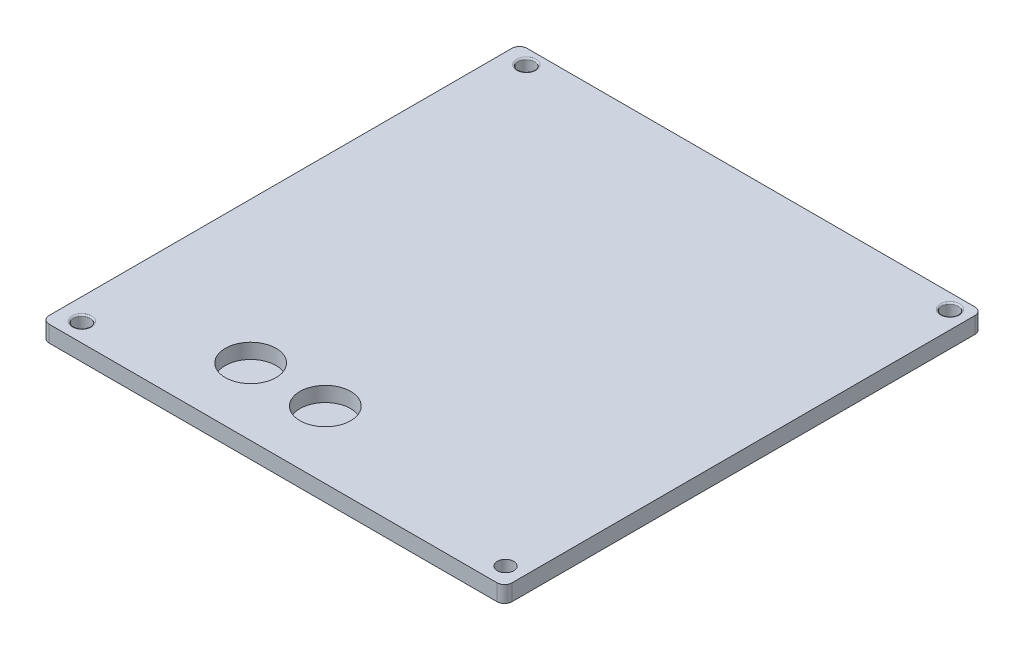
ISO-10303-21;
HEADER;
FILE_DESCRIPTION(('STEP AP214'),'2;1');
FILE_NAME('part.step','',(''),(''),'','','');
FILE_SCHEMA(('AUTOMOTIVE_DESIGN { 1 0 10303 214 1 1 1 1 }'));
ENDSEC;
DATA;
#1=APPLICATION_CONTEXT('core data for automotive mechanical design processes');
#2=APPLICATION_PROTOCOL_DEFINITION('international standard','automotive_design',2000,#1);
#3=PRODUCT_CONTEXT('',#1,'mechanical');
#4=PRODUCT('Part','Part','',(#3));
#5=PRODUCT_RELATED_PRODUCT_CATEGORY('part','',(#4));
#6=PRODUCT_DEFINITION_FORMATION('','',#4);
#7=PRODUCT_DEFINITION_CONTEXT('part definition',#1,'design');
#8=PRODUCT_DEFINITION('design','',#6,#7);
#9=PRODUCT_DEFINITION_SHAPE('','',#8);
#10=(LENGTH_UNIT() NAMED_UNIT(*) SI_UNIT(.MILLI.,.METRE.));
#11=(NAMED_UNIT(*) PLANE_ANGLE_UNIT() SI_UNIT($,.RADIAN.));
#12=(NAMED_UNIT(*) SI_UNIT($,.STERADIAN.) SOLID_ANGLE_UNIT());
#13=UNCERTAINTY_MEASURE_WITH_UNIT(LENGTH_MEASURE(1.E-05),#10,'distance_accuracy_value','');
#14=(GEOMETRIC_REPRESENTATION_CONTEXT(3) GLOBAL_UNCERTAINTY_ASSIGNED_CONTEXT((#13)) GLOBAL_UNIT_ASSIGNED_CONTEXT((#10,
#11,#12)) REPRESENTATION_CONTEXT('',''));
#15=CARTESIAN_POINT('',(0.,0.,0.));
#16=DIRECTION('',(0.,0.,1.));
#17=DIRECTION('',(1.,0.,0.));
#18=AXIS2_PLACEMENT_3D('',#15,#16,#17);
#19=CARTESIAN_POINT('',(31.,2.2,32.));
#20=DIRECTION('',(-1.,0.,0.));
#21=DIRECTION('',(0.,0.,1.));
#22=AXIS2_PLACEMENT_3D('',#19,#20,#21);
#23=PLANE('',#22);
#24=DIRECTION('',(0.,0.,-1.));
#25=VECTOR('',#24,1.);
#26=CARTESIAN_POINT('',(31.,2.2,32.));
#27=LINE('',#26,#25);
#28=CARTESIAN_POINT('',(31.,2.2,31.));
#29=VERTEX_POINT('',#28);
#30=CARTESIAN_POINT('',(31.,2.2,-31.));
#31=VERTEX_POINT('',#30);
#32=EDGE_CURVE('E124',#29,#31,#27,.T.);
#33=ORIENTED_EDGE('',*,*,#32,.F.);
#34=DIRECTION('',(0.,-1.,0.));
#35=VECTOR('',#34,1.);
#36=CARTESIAN_POINT('',(31.,2.2,31.));
#37=LINE('',#36,#35);
#38=CARTESIAN_POINT('',(31.,0.,31.));
#39=VERTEX_POINT('',#38);
#40=EDGE_CURVE('E193',#29,#39,#37,.T.);
#41=ORIENTED_EDGE('',*,*,#40,.T.);
#42=DIRECTION('',(0.,0.,-1.));
#43=VECTOR('',#42,1.);
#44=CARTESIAN_POINT('',(31.,0.,32.));
#45=LINE('',#44,#43);
#46=CARTESIAN_POINT('',(31.,0.,-31.));
#47=VERTEX_POINT('',#46);
#48=EDGE_CURVE('E210',#39,#47,#45,.T.);
#49=ORIENTED_EDGE('',*,*,#48,.T.);
#50=DIRECTION('',(0.,-1.,0.));
#51=VECTOR('',#50,1.);
#52=CARTESIAN_POINT('',(31.,2.2,-31.));
#53=LINE('',#52,#51);
#54=EDGE_CURVE('E186',#47,#31,#53,.F.);
#55=ORIENTED_EDGE('',*,*,#54,.T.);
#56=EDGE_LOOP('',(#33,#41,#49,#55));
#57=FACE_BOUND('',#56,.T.);
#58=ADVANCED_FACE('F39',(#57),#23,.F.);
#59=CARTESIAN_POINT('',(-31.,2.2,-32.));
#60=DIRECTION('',(0.,0.,1.));
#61=DIRECTION('',(1.,0.,0.));
#62=AXIS2_PLACEMENT_3D('',#59,#60,#61);
#63=PLANE('',#62);
#64=DIRECTION('',(-1.,0.,0.));
#65=VECTOR('',#64,1.);
#66=CARTESIAN_POINT('',(-31.,2.2,-32.));
#67=LINE('',#66,#65);
#68=CARTESIAN_POINT('',(30.,2.2,-32.));
#69=VERTEX_POINT('',#68);
#70=CARTESIAN_POINT('',(-30.,2.2,-32.));
#71=VERTEX_POINT('',#70);
#72=EDGE_CURVE('E129',#69,#71,#67,.T.);
#73=ORIENTED_EDGE('',*,*,#72,.F.);
#74=DIRECTION('',(0.,-1.,0.));
#75=VECTOR('',#74,1.);
#76=CARTESIAN_POINT('',(30.,2.2,-32.));
#77=LINE('',#76,#75);
#78=CARTESIAN_POINT('',(30.,0.,-32.));
#79=VERTEX_POINT('',#78);
#80=EDGE_CURVE('E178',#69,#79,#77,.T.);
#81=ORIENTED_EDGE('',*,*,#80,.T.);
#82=DIRECTION('',(-1.,0.,0.));
#83=VECTOR('',#82,1.);
#84=CARTESIAN_POINT('',(-31.,0.,-32.));
#85=LINE('',#84,#83);
#86=CARTESIAN_POINT('',(-30.,0.,-32.));
#87=VERTEX_POINT('',#86);
#88=EDGE_CURVE('E131',#79,#87,#85,.T.);
#89=ORIENTED_EDGE('',*,*,#88,.T.);
#90=DIRECTION('',(0.,-1.,0.));
#91=VECTOR('',#90,1.);
#92=CARTESIAN_POINT('',(-30.,2.2,-32.));
#93=LINE('',#92,#91);
#94=EDGE_CURVE('E171',#87,#71,#93,.F.);
#95=ORIENTED_EDGE('',*,*,#94,.T.);
#96=EDGE_LOOP('',(#73,#81,#89,#95));
#97=FACE_BOUND('',#96,.T.);
#98=ADVANCED_FACE('F216',(#97),#63,.F.);
#99=CARTESIAN_POINT('',(-31.,2.2,32.));
#100=DIRECTION('',(1.,0.,0.));
#101=DIRECTION('',(0.,0.,-1.));
#102=AXIS2_PLACEMENT_3D('',#99,#100,#101);
#103=PLANE('',#102);
#104=DIRECTION('',(0.,0.,1.));
#105=VECTOR('',#104,1.);
#106=CARTESIAN_POINT('',(-31.,2.2,32.));
#107=LINE('',#106,#105);
#108=CARTESIAN_POINT('',(-31.,2.2,-31.));
#109=VERTEX_POINT('',#108);
#110=CARTESIAN_POINT('',(-31.,2.2,31.));
#111=VERTEX_POINT('',#110);
#112=EDGE_CURVE('E201',#109,#111,#107,.T.);
#113=ORIENTED_EDGE('',*,*,#112,.F.);
#114=DIRECTION('',(0.,-1.,0.));
#115=VECTOR('',#114,1.);
#116=CARTESIAN_POINT('',(-31.,2.2,-31.));
#117=LINE('',#116,#115);
#118=CARTESIAN_POINT('',(-31.,0.,-31.));
#119=VERTEX_POINT('',#118);
#120=EDGE_CURVE('E163',#109,#119,#117,.T.);
#121=ORIENTED_EDGE('',*,*,#120,.T.);
#122=DIRECTION('',(0.,0.,1.));
#123=VECTOR('',#122,1.);
#124=CARTESIAN_POINT('',(-31.,0.,32.));
#125=LINE('',#124,#123);
#126=CARTESIAN_POINT('',(-31.,0.,31.));
#127=VERTEX_POINT('',#126);
#128=EDGE_CURVE('E125',#119,#127,#125,.T.);
#129=ORIENTED_EDGE('',*,*,#128,.T.);
#130=DIRECTION('',(0.,-1.,0.));
#131=VECTOR('',#130,1.);
#132=CARTESIAN_POINT('',(-31.,2.2,31.));
#133=LINE('',#132,#131);
#134=EDGE_CURVE('E112',#127,#111,#133,.F.);
#135=ORIENTED_EDGE('',*,*,#134,.T.);
#136=EDGE_LOOP('',(#113,#121,#129,#135));
#137=FACE_BOUND('',#136,.T.);
#138=ADVANCED_FACE('F226',(#137),#103,.F.);
#139=CARTESIAN_POINT('',(-31.,2.2,32.));
#140=DIRECTION('',(0.,0.,-1.));
#141=DIRECTION('',(-1.,0.,0.));
#142=AXIS2_PLACEMENT_3D('',#139,#140,#141);
#143=PLANE('',#142);
#144=DIRECTION('',(1.,0.,0.));
#145=VECTOR('',#144,1.);
#146=CARTESIAN_POINT('',(-31.,0.,32.));
#147=LINE('',#146,#145);
#148=CARTESIAN_POINT('',(-30.,0.,32.));
#149=VERTEX_POINT('',#148);
#150=CARTESIAN_POINT('',(30.,0.,32.));
#151=VERTEX_POINT('',#150);
#152=EDGE_CURVE('E117',#149,#151,#147,.T.);
#153=ORIENTED_EDGE('',*,*,#152,.T.);
#154=DIRECTION('',(0.,-1.,0.));
#155=VECTOR('',#154,1.);
#156=CARTESIAN_POINT('',(30.,2.2,32.));
#157=LINE('',#156,#155);
#158=CARTESIAN_POINT('',(30.,2.2,32.));
#159=VERTEX_POINT('',#158);
#160=EDGE_CURVE('E48',#151,#159,#157,.F.);
#161=ORIENTED_EDGE('',*,*,#160,.T.);
#162=DIRECTION('',(1.,0.,0.));
#163=VECTOR('',#162,1.);
#164=CARTESIAN_POINT('',(-31.,2.2,32.));
#165=LINE('',#164,#163);
#166=CARTESIAN_POINT('',(-30.,2.2,32.));
#167=VERTEX_POINT('',#166);
#168=EDGE_CURVE('E118',#167,#159,#165,.T.);
#169=ORIENTED_EDGE('',*,*,#168,.F.);
#170=DIRECTION('',(0.,-1.,0.));
#171=VECTOR('',#170,1.);
#172=CARTESIAN_POINT('',(-30.,2.2,32.));
#173=LINE('',#172,#171);
#174=EDGE_CURVE('E110',#167,#149,#173,.T.);
#175=ORIENTED_EDGE('',*,*,#174,.T.);
#176=EDGE_LOOP('',(#153,#161,#169,#175));
#177=FACE_BOUND('',#176,.T.);
#178=ADVANCED_FACE('F116',(#177),#143,.F.);
#179=CARTESIAN_POINT('',(0.,2.2,0.));
#180=DIRECTION('',(0.,-1.,0.));
#181=DIRECTION('',(0.,0.,-1.));
#182=AXIS2_PLACEMENT_3D('',#179,#180,#181);
#183=PLANE('',#182);
#184=CARTESIAN_POINT('',(-28.1190002669969,2.2,29.4898461895664));
#185=DIRECTION('',(0.,-1.,0.));
#186=DIRECTION('',(0.,0.,-1.));
#187=AXIS2_PLACEMENT_3D('',#184,#185,#186);
#188=CIRCLE('',#187,1.3);
#189=CARTESIAN_POINT('',(-28.1190002669969,2.2,28.1898461895663));
#190=VERTEX_POINT('',#189);
#191=EDGE_CURVE('E120',#190,#190,#188,.T.);
#192=ORIENTED_EDGE('',*,*,#191,.T.);
#193=EDGE_LOOP('',(#192));
#194=FACE_BOUND('',#193,.T.);
#195=CARTESIAN_POINT('',(28.6256489204563,2.2,-30.0413705919135));
#196=DIRECTION('',(0.,-1.,0.));
#197=DIRECTION('',(0.,0.,-1.));
#198=AXIS2_PLACEMENT_3D('',#195,#196,#197);
#199=CIRCLE('',#198,1.3);
#200=CARTESIAN_POINT('',(28.6256489204563,2.2,-31.3413705919135));
#201=VERTEX_POINT('',#200);
#202=EDGE_CURVE('E147',#201,#201,#199,.T.);
#203=ORIENTED_EDGE('',*,*,#202,.T.);
#204=EDGE_LOOP('',(#203));
#205=FACE_BOUND('',#204,.T.);
#206=CARTESIAN_POINT('',(-28.1190002669969,2.2,-30.0413705919135));
#207=DIRECTION('',(0.,-1.,0.));
#208=DIRECTION('',(0.,0.,-1.));
#209=AXIS2_PLACEMENT_3D('',#206,#207,#208);
#210=CIRCLE('',#209,1.3);
#211=CARTESIAN_POINT('',(-28.1190002669969,2.2,-31.3413705919135));
#212=VERTEX_POINT('',#211);
#213=EDGE_CURVE('E139',#212,#212,#210,.T.);
#214=ORIENTED_EDGE('',*,*,#213,.T.);
#215=EDGE_LOOP('',(#214));
#216=FACE_BOUND('',#215,.T.);
#217=CARTESIAN_POINT('',(28.6256489204563,2.2,29.4898461895664));
#218=DIRECTION('',(0.,1.,0.));
#219=DIRECTION('',(0.,0.,1.));
#220=AXIS2_PLACEMENT_3D('',#217,#218,#219);
#221=CIRCLE('',#220,1.1);
#222=CARTESIAN_POINT('',(28.6256489204563,2.2,30.5898461895663));
#223=VERTEX_POINT('',#222);
#224=EDGE_CURVE('E480',#223,#223,#221,.T.);
#225=ORIENTED_EDGE('',*,*,#224,.F.);
#226=EDGE_LOOP('',(#225));
#227=FACE_BOUND('',#226,.T.);
#228=CARTESIAN_POINT('',(-12.,2.2,23.));
#229=DIRECTION('',(0.,1.,0.));
#230=DIRECTION('',(0.,0.,1.));
#231=AXIS2_PLACEMENT_3D('',#228,#229,#230);
#232=CIRCLE('',#231,3.4);
#233=CARTESIAN_POINT('',(-12.,2.2,26.4));
#234=VERTEX_POINT('',#233);
#235=EDGE_CURVE('E486',#234,#234,#232,.T.);
#236=ORIENTED_EDGE('',*,*,#235,.F.);
#237=EDGE_LOOP('',(#236));
#238=FACE_BOUND('',#237,.T.);
#239=CARTESIAN_POINT('',(-2.,2.2,23.));
#240=DIRECTION('',(0.,1.,0.));
#241=DIRECTION('',(0.,0.,1.));
#242=AXIS2_PLACEMENT_3D('',#239,#240,#241);
#243=CIRCLE('',#242,3.4);
#244=CARTESIAN_POINT('',(-2.,2.2,26.4));
#245=VERTEX_POINT('',#244);
#246=EDGE_CURVE('E474',#245,#245,#243,.T.);
#247=ORIENTED_EDGE('',*,*,#246,.F.);
#248=EDGE_LOOP('',(#247));
#249=FACE_BOUND('',#248,.T.);
#250=ORIENTED_EDGE('',*,*,#168,.T.);
#251=CARTESIAN_POINT('',(30.,2.2,31.));
#252=DIRECTION('',(0.,-1.,0.));
#253=DIRECTION('',(0.,0.,-1.));
#254=AXIS2_PLACEMENT_3D('',#251,#252,#253);
#255=CIRCLE('',#254,1.);
#256=EDGE_CURVE('E11',#159,#29,#255,.F.);
#257=ORIENTED_EDGE('',*,*,#256,.T.);
#258=ORIENTED_EDGE('',*,*,#32,.T.);
#259=CARTESIAN_POINT('',(30.,2.2,-31.));
#260=DIRECTION('',(0.,-1.,0.));
#261=DIRECTION('',(0.,0.,-1.));
#262=AXIS2_PLACEMENT_3D('',#259,#260,#261);
#263=CIRCLE('',#262,1.);
#264=EDGE_CURVE('E190',#31,#69,#263,.F.);
#265=ORIENTED_EDGE('',*,*,#264,.T.);
#266=ORIENTED_EDGE('',*,*,#72,.T.);
#267=CARTESIAN_POINT('',(-30.,2.2,-31.));
#268=DIRECTION('',(0.,-1.,0.));
#269=DIRECTION('',(0.,0.,-1.));
#270=AXIS2_PLACEMENT_3D('',#267,#268,#269);
#271=CIRCLE('',#270,1.);
#272=EDGE_CURVE('E175',#71,#109,#271,.F.);
#273=ORIENTED_EDGE('',*,*,#272,.T.);
#274=ORIENTED_EDGE('',*,*,#112,.T.);
#275=CARTESIAN_POINT('',(-30.,2.2,31.));
#276=DIRECTION('',(0.,-1.,0.));
#277=DIRECTION('',(0.,0.,-1.));
#278=AXIS2_PLACEMENT_3D('',#275,#276,#277);
#279=CIRCLE('',#278,1.);
#280=EDGE_CURVE('E160',#111,#167,#279,.F.);
#281=ORIENTED_EDGE('',*,*,#280,.T.);
#282=EDGE_LOOP('',(#250,#257,#258,#265,#266,#273,#274,#281));
#283=FACE_BOUND('',#282,.T.);
#284=ADVANCED_FACE('F224',(#194,#205,#216,#227,#238,#249,#283),#183,.F.);
#285=CARTESIAN_POINT('',(0.,0.,0.));
#286=DIRECTION('',(0.,-1.,0.));
#287=DIRECTION('',(0.,0.,-1.));
#288=AXIS2_PLACEMENT_3D('',#285,#286,#287);
#289=PLANE('',#288);
#290=ORIENTED_EDGE('',*,*,#48,.F.);
#291=CARTESIAN_POINT('',(30.,0.,31.));
#292=DIRECTION('',(0.,-1.,0.));
#293=DIRECTION('',(0.,0.,-1.));
#294=AXIS2_PLACEMENT_3D('',#291,#292,#293);
#295=CIRCLE('',#294,1.);
#296=EDGE_CURVE('E62',#39,#151,#295,.T.);
#297=ORIENTED_EDGE('',*,*,#296,.T.);
#298=ORIENTED_EDGE('',*,*,#152,.F.);
#299=CARTESIAN_POINT('',(-30.,0.,31.));
#300=DIRECTION('',(0.,-1.,0.));
#301=DIRECTION('',(0.,0.,-1.));
#302=AXIS2_PLACEMENT_3D('',#299,#300,#301);
#303=CIRCLE('',#302,1.);
#304=EDGE_CURVE('E106',#149,#127,#303,.T.);
#305=ORIENTED_EDGE('',*,*,#304,.T.);
#306=ORIENTED_EDGE('',*,*,#128,.F.);
#307=CARTESIAN_POINT('',(-30.,0.,-31.));
#308=DIRECTION('',(0.,-1.,0.));
#309=DIRECTION('',(0.,0.,-1.));
#310=AXIS2_PLACEMENT_3D('',#307,#308,#309);
#311=CIRCLE('',#310,1.);
#312=EDGE_CURVE('E167',#119,#87,#311,.T.);
#313=ORIENTED_EDGE('',*,*,#312,.T.);
#314=ORIENTED_EDGE('',*,*,#88,.F.);
#315=CARTESIAN_POINT('',(30.,0.,-31.));
#316=DIRECTION('',(0.,-1.,0.));
#317=DIRECTION('',(0.,0.,-1.));
#318=AXIS2_PLACEMENT_3D('',#315,#316,#317);
#319=CIRCLE('',#318,1.);
#320=EDGE_CURVE('E182',#79,#47,#319,.T.);
#321=ORIENTED_EDGE('',*,*,#320,.T.);
#322=EDGE_LOOP('',(#290,#297,#298,#305,#306,#313,#314,#321));
#323=FACE_BOUND('',#322,.T.);
#324=ADVANCED_FACE('F122',(#323),#289,.T.);
#325=CARTESIAN_POINT('',(-2.,0.2,23.));
#326=DIRECTION('',(0.,1.,0.));
#327=DIRECTION('',(0.,0.,1.));
#328=AXIS2_PLACEMENT_3D('',#325,#326,#327);
#329=CYLINDRICAL_SURFACE('',#328,3.4);
#330=CARTESIAN_POINT('',(-2.,0.2,23.));
#331=DIRECTION('',(0.,1.,0.));
#332=DIRECTION('',(0.,0.,1.));
#333=AXIS2_PLACEMENT_3D('',#330,#331,#332);
#334=CIRCLE('',#333,3.4);
#335=CARTESIAN_POINT('',(-2.,0.2,26.4));
#336=VERTEX_POINT('',#335);
#337=EDGE_CURVE('E490',#336,#336,#334,.T.);
#338=ORIENTED_EDGE('',*,*,#337,.F.);
#339=EDGE_LOOP('',(#338));
#340=FACE_BOUND('',#339,.T.);
#341=ORIENTED_EDGE('',*,*,#246,.T.);
#342=EDGE_LOOP('',(#341));
#343=FACE_BOUND('',#342,.T.);
#344=ADVANCED_FACE('F317',(#340,#343),#329,.F.);
#345=CARTESIAN_POINT('',(-2.,0.2,23.));
#346=DIRECTION('',(0.,1.,0.));
#347=DIRECTION('',(0.,0.,1.));
#348=AXIS2_PLACEMENT_3D('',#345,#346,#347);
#349=PLANE('',#348);
#350=ORIENTED_EDGE('',*,*,#337,.T.);
#351=EDGE_LOOP('',(#350));
#352=FACE_BOUND('',#351,.T.);
#353=ADVANCED_FACE('F331',(#352),#349,.T.);
#354=CARTESIAN_POINT('',(-12.,0.2,23.));
#355=DIRECTION('',(0.,1.,0.));
#356=DIRECTION('',(0.,0.,1.));
#357=AXIS2_PLACEMENT_3D('',#354,#355,#356);
#358=CYLINDRICAL_SURFACE('',#357,3.4);
#359=CARTESIAN_POINT('',(-12.,0.2,23.));
#360=DIRECTION('',(0.,1.,0.));
#361=DIRECTION('',(0.,0.,1.));
#362=AXIS2_PLACEMENT_3D('',#359,#360,#361);
#363=CIRCLE('',#362,3.4);
#364=CARTESIAN_POINT('',(-12.,0.2,26.4));
#365=VERTEX_POINT('',#364);
#366=EDGE_CURVE('E212',#365,#365,#363,.T.);
#367=ORIENTED_EDGE('',*,*,#366,.F.);
#368=EDGE_LOOP('',(#367));
#369=FACE_BOUND('',#368,.T.);
#370=ORIENTED_EDGE('',*,*,#235,.T.);
#371=EDGE_LOOP('',(#370));
#372=FACE_BOUND('',#371,.T.);
#373=ADVANCED_FACE('F338',(#369,#372),#358,.F.);
#374=CARTESIAN_POINT('',(-12.,0.2,23.));
#375=DIRECTION('',(0.,1.,0.));
#376=DIRECTION('',(0.,0.,1.));
#377=AXIS2_PLACEMENT_3D('',#374,#375,#376);
#378=PLANE('',#377);
#379=ORIENTED_EDGE('',*,*,#366,.T.);
#380=EDGE_LOOP('',(#379));
#381=FACE_BOUND('',#380,.T.);
#382=ADVANCED_FACE('F346',(#381),#378,.T.);
#383=CARTESIAN_POINT('',(-28.1190002669969,0.2,-30.0413705919135));
#384=DIRECTION('',(0.,1.,0.));
#385=DIRECTION('',(0.,0.,1.));
#386=AXIS2_PLACEMENT_3D('',#383,#384,#385);
#387=CYLINDRICAL_SURFACE('',#386,1.1);
#388=CARTESIAN_POINT('',(-28.1190002669969,2.,-30.0413705919135));
#389=DIRECTION('',(0.,-1.,0.));
#390=DIRECTION('',(0.,0.,-1.));
#391=AXIS2_PLACEMENT_3D('',#388,#389,#390);
#392=CIRCLE('',#391,1.1);
#393=CARTESIAN_POINT('',(-28.1190002669969,2.,-31.1413705919135));
#394=VERTEX_POINT('',#393);
#395=EDGE_CURVE('E135',#394,#394,#392,.F.);
#396=ORIENTED_EDGE('',*,*,#395,.T.);
#397=EDGE_LOOP('',(#396));
#398=FACE_BOUND('',#397,.T.);
#399=CARTESIAN_POINT('',(-28.1190002669969,0.2,-30.0413705919135));
#400=DIRECTION('',(0.,1.,0.));
#401=DIRECTION('',(0.,0.,1.));
#402=AXIS2_PLACEMENT_3D('',#399,#400,#401);
#403=CIRCLE('',#402,1.1);
#404=CARTESIAN_POINT('',(-28.1190002669969,0.2,-28.9413705919135));
#405=VERTEX_POINT('',#404);
#406=EDGE_CURVE('E468',#405,#405,#403,.T.);
#407=ORIENTED_EDGE('',*,*,#406,.F.);
#408=EDGE_LOOP('',(#407));
#409=FACE_BOUND('',#408,.T.);
#410=ADVANCED_FACE('F354',(#398,#409),#387,.F.);
#411=CARTESIAN_POINT('',(-28.1190002669969,0.2,-30.0413705919135));
#412=DIRECTION('',(0.,1.,0.));
#413=DIRECTION('',(0.,0.,1.));
#414=AXIS2_PLACEMENT_3D('',#411,#412,#413);
#415=PLANE('',#414);
#416=ORIENTED_EDGE('',*,*,#406,.T.);
#417=EDGE_LOOP('',(#416));
#418=FACE_BOUND('',#417,.T.);
#419=ADVANCED_FACE('F363',(#418),#415,.T.);
#420=CARTESIAN_POINT('',(28.6256489204563,0.2,29.4898461895664));
#421=DIRECTION('',(0.,1.,0.));
#422=DIRECTION('',(0.,0.,1.));
#423=AXIS2_PLACEMENT_3D('',#420,#421,#422);
#424=CYLINDRICAL_SURFACE('',#423,1.1);
#425=CARTESIAN_POINT('',(28.6256489204563,0.2,29.4898461895664));
#426=DIRECTION('',(0.,1.,0.));
#427=DIRECTION('',(0.,0.,1.));
#428=AXIS2_PLACEMENT_3D('',#425,#426,#427);
#429=CIRCLE('',#428,1.1);
#430=CARTESIAN_POINT('',(28.6256489204563,0.2,30.5898461895663));
#431=VERTEX_POINT('',#430);
#432=EDGE_CURVE('E477',#431,#431,#429,.T.);
#433=ORIENTED_EDGE('',*,*,#432,.F.);
#434=EDGE_LOOP('',(#433));
#435=FACE_BOUND('',#434,.T.);
#436=ORIENTED_EDGE('',*,*,#224,.T.);
#437=EDGE_LOOP('',(#436));
#438=FACE_BOUND('',#437,.T.);
#439=ADVANCED_FACE('F372',(#435,#438),#424,.F.);
#440=CARTESIAN_POINT('',(28.6256489204563,0.2,29.4898461895664));
#441=DIRECTION('',(0.,1.,0.));
#442=DIRECTION('',(0.,0.,1.));
#443=AXIS2_PLACEMENT_3D('',#440,#441,#442);
#444=PLANE('',#443);
#445=ORIENTED_EDGE('',*,*,#432,.T.);
#446=EDGE_LOOP('',(#445));
#447=FACE_BOUND('',#446,.T.);
#448=ADVANCED_FACE('F380',(#447),#444,.T.);
#449=CARTESIAN_POINT('',(-28.1190002669969,0.2,29.4898461895664));
#450=DIRECTION('',(0.,1.,0.));
#451=DIRECTION('',(0.,0.,1.));
#452=AXIS2_PLACEMENT_3D('',#449,#450,#451);
#453=CYLINDRICAL_SURFACE('',#452,1.1);
#454=CARTESIAN_POINT('',(-28.1190002669969,2.,29.4898461895664));
#455=DIRECTION('',(0.,-1.,0.));
#456=DIRECTION('',(0.,0.,-1.));
#457=AXIS2_PLACEMENT_3D('',#454,#455,#456);
#458=CIRCLE('',#457,1.1);
#459=CARTESIAN_POINT('',(-28.1190002669969,2.,28.3898461895663));
#460=VERTEX_POINT('',#459);
#461=EDGE_CURVE('E151',#460,#460,#458,.F.);
#462=ORIENTED_EDGE('',*,*,#461,.T.);
#463=EDGE_LOOP('',(#462));
#464=FACE_BOUND('',#463,.T.);
#465=CARTESIAN_POINT('',(-28.1190002669969,0.2,29.4898461895664));
#466=DIRECTION('',(0.,1.,0.));
#467=DIRECTION('',(0.,0.,1.));
#468=AXIS2_PLACEMENT_3D('',#465,#466,#467);
#469=CIRCLE('',#468,1.1);
#470=CARTESIAN_POINT('',(-28.1190002669969,0.2,30.5898461895663));
#471=VERTEX_POINT('',#470);
#472=EDGE_CURVE('E469',#471,#471,#469,.T.);
#473=ORIENTED_EDGE('',*,*,#472,.F.);
#474=EDGE_LOOP('',(#473));
#475=FACE_BOUND('',#474,.T.);
#476=ADVANCED_FACE('F388',(#464,#475),#453,.F.);
#477=CARTESIAN_POINT('',(-28.1190002669969,0.2,29.4898461895664));
#478=DIRECTION('',(0.,1.,0.));
#479=DIRECTION('',(0.,0.,1.));
#480=AXIS2_PLACEMENT_3D('',#477,#478,#479);
#481=PLANE('',#480);
#482=ORIENTED_EDGE('',*,*,#472,.T.);
#483=EDGE_LOOP('',(#482));
#484=FACE_BOUND('',#483,.T.);
#485=ADVANCED_FACE('F397',(#484),#481,.T.);
#486=CARTESIAN_POINT('',(28.6256489204563,0.2,-30.0413705919135));
#487=DIRECTION('',(0.,1.,0.));
#488=DIRECTION('',(0.,0.,1.));
#489=AXIS2_PLACEMENT_3D('',#486,#487,#488);
#490=CYLINDRICAL_SURFACE('',#489,1.1);
#491=CARTESIAN_POINT('',(28.6256489204563,2.,-30.0413705919135));
#492=DIRECTION('',(0.,-1.,0.));
#493=DIRECTION('',(0.,0.,-1.));
#494=AXIS2_PLACEMENT_3D('',#491,#492,#493);
#495=CIRCLE('',#494,1.1);
#496=CARTESIAN_POINT('',(28.6256489204563,2.,-31.1413705919135));
#497=VERTEX_POINT('',#496);
#498=EDGE_CURVE('E143',#497,#497,#495,.F.);
#499=ORIENTED_EDGE('',*,*,#498,.T.);
#500=EDGE_LOOP('',(#499));
#501=FACE_BOUND('',#500,.T.);
#502=CARTESIAN_POINT('',(28.6256489204563,0.2,-30.0413705919135));
#503=DIRECTION('',(0.,1.,0.));
#504=DIRECTION('',(0.,0.,1.));
#505=AXIS2_PLACEMENT_3D('',#502,#503,#504);
#506=CIRCLE('',#505,1.1);
#507=CARTESIAN_POINT('',(28.6256489204563,0.2,-28.9413705919135));
#508=VERTEX_POINT('',#507);
#509=EDGE_CURVE('E465',#508,#508,#506,.T.);
#510=ORIENTED_EDGE('',*,*,#509,.F.);
#511=EDGE_LOOP('',(#510));
#512=FACE_BOUND('',#511,.T.);
#513=ADVANCED_FACE('F405',(#501,#512),#490,.F.);
#514=CARTESIAN_POINT('',(28.6256489204563,0.2,-30.0413705919135));
#515=DIRECTION('',(0.,1.,0.));
#516=DIRECTION('',(0.,0.,1.));
#517=AXIS2_PLACEMENT_3D('',#514,#515,#516);
#518=PLANE('',#517);
#519=ORIENTED_EDGE('',*,*,#509,.T.);
#520=EDGE_LOOP('',(#519));
#521=FACE_BOUND('',#520,.T.);
#522=ADVANCED_FACE('F254',(#521),#518,.T.);
#523=CARTESIAN_POINT('',(-28.1190002669969,2.,-30.0413705919135));
#524=DIRECTION('',(0.,-1.,0.));
#525=DIRECTION('',(0.,0.,-1.));
#526=AXIS2_PLACEMENT_3D('',#523,#524,#525);
#527=TOROIDAL_SURFACE('',#526,1.3,0.2);
#528=ORIENTED_EDGE('',*,*,#213,.F.);
#529=EDGE_LOOP('',(#528));
#530=FACE_BOUND('',#529,.T.);
#531=ORIENTED_EDGE('',*,*,#395,.F.);
#532=EDGE_LOOP('',(#531));
#533=FACE_BOUND('',#532,.T.);
#534=ADVANCED_FACE('F250',(#530,#533),#527,.T.);
#535=CARTESIAN_POINT('',(28.6256489204563,2.,-30.0413705919135));
#536=DIRECTION('',(0.,-1.,0.));
#537=DIRECTION('',(0.,0.,-1.));
#538=AXIS2_PLACEMENT_3D('',#535,#536,#537);
#539=TOROIDAL_SURFACE('',#538,1.3,0.2);
#540=ORIENTED_EDGE('',*,*,#202,.F.);
#541=EDGE_LOOP('',(#540));
#542=FACE_BOUND('',#541,.T.);
#543=ORIENTED_EDGE('',*,*,#498,.F.);
#544=EDGE_LOOP('',(#543));
#545=FACE_BOUND('',#544,.T.);
#546=ADVANCED_FACE('F253',(#542,#545),#539,.T.);
#547=CARTESIAN_POINT('',(-28.1190002669969,2.,29.4898461895664));
#548=DIRECTION('',(0.,-1.,0.));
#549=DIRECTION('',(0.,0.,-1.));
#550=AXIS2_PLACEMENT_3D('',#547,#548,#549);
#551=TOROIDAL_SURFACE('',#550,1.3,0.2);
#552=ORIENTED_EDGE('',*,*,#191,.F.);
#553=EDGE_LOOP('',(#552));
#554=FACE_BOUND('',#553,.T.);
#555=ORIENTED_EDGE('',*,*,#461,.F.);
#556=EDGE_LOOP('',(#555));
#557=FACE_BOUND('',#556,.T.);
#558=ADVANCED_FACE('F258',(#554,#557),#551,.T.);
#559=CARTESIAN_POINT('',(-30.,2.2,31.));
#560=DIRECTION('',(0.,-1.,0.));
#561=DIRECTION('',(0.,0.,-1.));
#562=AXIS2_PLACEMENT_3D('',#559,#560,#561);
#563=CYLINDRICAL_SURFACE('',#562,1.);
#564=ORIENTED_EDGE('',*,*,#280,.F.);
#565=ORIENTED_EDGE('',*,*,#134,.F.);
#566=ORIENTED_EDGE('',*,*,#304,.F.);
#567=ORIENTED_EDGE('',*,*,#174,.F.);
#568=EDGE_LOOP('',(#564,#565,#566,#567));
#569=FACE_BOUND('',#568,.T.);
#570=ADVANCED_FACE('F109',(#569),#563,.T.);
#571=CARTESIAN_POINT('',(-30.,2.2,-31.));
#572=DIRECTION('',(0.,-1.,0.));
#573=DIRECTION('',(0.,0.,-1.));
#574=AXIS2_PLACEMENT_3D('',#571,#572,#573);
#575=CYLINDRICAL_SURFACE('',#574,1.);
#576=ORIENTED_EDGE('',*,*,#272,.F.);
#577=ORIENTED_EDGE('',*,*,#94,.F.);
#578=ORIENTED_EDGE('',*,*,#312,.F.);
#579=ORIENTED_EDGE('',*,*,#120,.F.);
#580=EDGE_LOOP('',(#576,#577,#578,#579));
#581=FACE_BOUND('',#580,.T.);
#582=ADVANCED_FACE('F222',(#581),#575,.T.);
#583=CARTESIAN_POINT('',(30.,2.2,-31.));
#584=DIRECTION('',(0.,-1.,0.));
#585=DIRECTION('',(0.,0.,-1.));
#586=AXIS2_PLACEMENT_3D('',#583,#584,#585);
#587=CYLINDRICAL_SURFACE('',#586,1.);
#588=ORIENTED_EDGE('',*,*,#264,.F.);
#589=ORIENTED_EDGE('',*,*,#54,.F.);
#590=ORIENTED_EDGE('',*,*,#320,.F.);
#591=ORIENTED_EDGE('',*,*,#80,.F.);
#592=EDGE_LOOP('',(#588,#589,#590,#591));
#593=FACE_BOUND('',#592,.T.);
#594=ADVANCED_FACE('F235',(#593),#587,.T.);
#595=CARTESIAN_POINT('',(30.,2.2,31.));
#596=DIRECTION('',(0.,-1.,0.));
#597=DIRECTION('',(0.,0.,-1.));
#598=AXIS2_PLACEMENT_3D('',#595,#596,#597);
#599=CYLINDRICAL_SURFACE('',#598,1.);
#600=ORIENTED_EDGE('',*,*,#256,.F.);
#601=ORIENTED_EDGE('',*,*,#160,.F.);
#602=ORIENTED_EDGE('',*,*,#296,.F.);
#603=ORIENTED_EDGE('',*,*,#40,.F.);
#604=EDGE_LOOP('',(#600,#601,#602,#603));
#605=FACE_BOUND('',#604,.T.);
#606=ADVANCED_FACE('F41',(#605),#599,.T.);
#607=CLOSED_SHELL('',(#58,#98,#138,#178,#284,#324,#344,#353,#373,#382,#410,#419,#439,#448,#476,
#485,#513,#522,#534,#546,#558,#570,#582,#594,#606));
#608=MANIFOLD_SOLID_BREP('B2',#607);
#609=ADVANCED_BREP_SHAPE_REPRESENTATION('',(#18,#608),#14);
#610=SHAPE_DEFINITION_REPRESENTATION(#9,#609);
ENDSEC;
END-ISO-10303-21;
